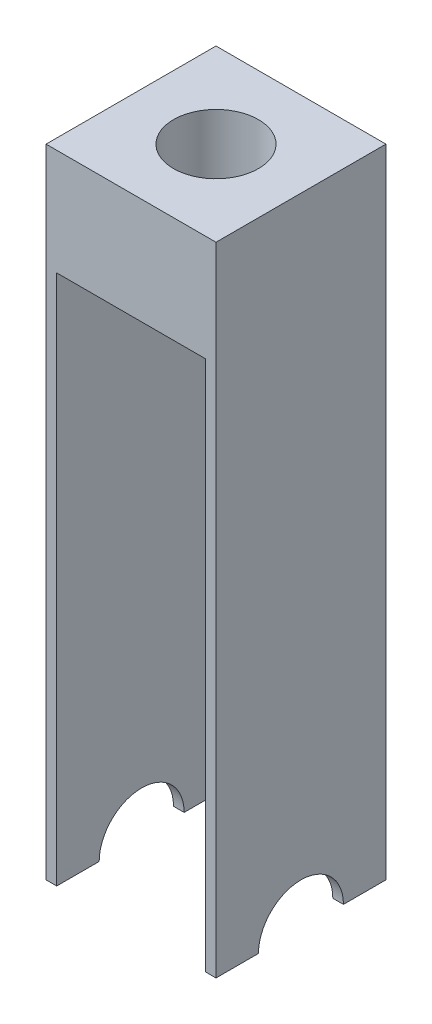
ISO-10303-21;
HEADER;
FILE_DESCRIPTION(('STEP AP214'),'2;1');
FILE_NAME('part.step','',(''),(''),'','','');
FILE_SCHEMA(('AUTOMOTIVE_DESIGN { 1 0 10303 214 1 1 1 1 }'));
ENDSEC;
DATA;
#1=APPLICATION_CONTEXT('core data for automotive mechanical design processes');
#2=APPLICATION_PROTOCOL_DEFINITION('international standard','automotive_design',2000,#1);
#3=PRODUCT_CONTEXT('',#1,'mechanical');
#4=PRODUCT('Part','Part','',(#3));
#5=PRODUCT_RELATED_PRODUCT_CATEGORY('part','',(#4));
#6=PRODUCT_DEFINITION_FORMATION('','',#4);
#7=PRODUCT_DEFINITION_CONTEXT('part definition',#1,'design');
#8=PRODUCT_DEFINITION('design','',#6,#7);
#9=PRODUCT_DEFINITION_SHAPE('','',#8);
#10=(LENGTH_UNIT() NAMED_UNIT(*) SI_UNIT(.MILLI.,.METRE.));
#11=(NAMED_UNIT(*) PLANE_ANGLE_UNIT() SI_UNIT($,.RADIAN.));
#12=(NAMED_UNIT(*) SI_UNIT($,.STERADIAN.) SOLID_ANGLE_UNIT());
#13=UNCERTAINTY_MEASURE_WITH_UNIT(LENGTH_MEASURE(1.E-05),#10,'distance_accuracy_value','');
#14=(GEOMETRIC_REPRESENTATION_CONTEXT(3) GLOBAL_UNCERTAINTY_ASSIGNED_CONTEXT((#13)) GLOBAL_UNIT_ASSIGNED_CONTEXT((#10,
#11,#12)) REPRESENTATION_CONTEXT('',''));
#15=CARTESIAN_POINT('',(0.,0.,0.));
#16=DIRECTION('',(0.,0.,1.));
#17=DIRECTION('',(1.,0.,0.));
#18=AXIS2_PLACEMENT_3D('',#15,#16,#17);
#19=CARTESIAN_POINT('',(80.,-150.,20.));
#20=DIRECTION('',(0.,1.,0.));
#21=DIRECTION('',(0.,0.,1.));
#22=AXIS2_PLACEMENT_3D('',#19,#20,#21);
#23=PLANE('',#22);
#24=DIRECTION('',(-1.,0.,0.));
#25=VECTOR('',#24,1.);
#26=CARTESIAN_POINT('',(80.,-150.,20.));
#27=LINE('',#26,#25);
#28=CARTESIAN_POINT('',(5.00000000000003,-150.,20.));
#29=VERTEX_POINT('',#28);
#30=CARTESIAN_POINT('',(0.,-150.,20.));
#31=VERTEX_POINT('',#30);
#32=EDGE_CURVE('E152',#29,#31,#27,.T.);
#33=ORIENTED_EDGE('',*,*,#32,.F.);
#34=DIRECTION('',(0.,0.,1.));
#35=VECTOR('',#34,1.);
#36=CARTESIAN_POINT('',(5.00000000000003,-150.,-40.));
#37=LINE('',#36,#35);
#38=CARTESIAN_POINT('',(5.00000000000003,-150.,40.));
#39=VERTEX_POINT('',#38);
#40=EDGE_CURVE('E209',#29,#39,#37,.T.);
#41=ORIENTED_EDGE('',*,*,#40,.T.);
#42=DIRECTION('',(-1.,0.,0.));
#43=VECTOR('',#42,1.);
#44=CARTESIAN_POINT('',(80.,-150.,40.));
#45=LINE('',#44,#43);
#46=CARTESIAN_POINT('',(0.,-150.,40.));
#47=VERTEX_POINT('',#46);
#48=EDGE_CURVE('E41',#39,#47,#45,.T.);
#49=ORIENTED_EDGE('',*,*,#48,.T.);
#50=DIRECTION('',(0.,0.,-1.));
#51=VECTOR('',#50,1.);
#52=CARTESIAN_POINT('',(0.,-150.,20.));
#53=LINE('',#52,#51);
#54=EDGE_CURVE('E135',#47,#31,#53,.T.);
#55=ORIENTED_EDGE('',*,*,#54,.T.);
#56=EDGE_LOOP('',(#33,#41,#49,#55));
#57=FACE_BOUND('',#56,.T.);
#58=ADVANCED_FACE('F33',(#57),#23,.F.);
#59=CARTESIAN_POINT('',(80.,-150.,0.));
#60=DIRECTION('',(-1.,0.,0.));
#61=DIRECTION('',(0.,0.,1.));
#62=AXIS2_PLACEMENT_3D('',#59,#60,#61);
#63=CYLINDRICAL_SURFACE('',#62,20.);
#64=DIRECTION('',(-1.,0.,0.));
#65=VECTOR('',#64,1.);
#66=CARTESIAN_POINT('',(80.,-150.,-20.));
#67=LINE('',#66,#65);
#68=CARTESIAN_POINT('',(5.00000000000003,-150.,-20.));
#69=VERTEX_POINT('',#68);
#70=CARTESIAN_POINT('',(0.,-150.,-20.));
#71=VERTEX_POINT('',#70);
#72=EDGE_CURVE('E122',#69,#71,#67,.T.);
#73=ORIENTED_EDGE('',*,*,#72,.F.);
#74=CARTESIAN_POINT('',(5.00000000000002,-150.,0.));
#75=DIRECTION('',(-1.,0.,0.));
#76=DIRECTION('',(0.,-1.,0.));
#77=AXIS2_PLACEMENT_3D('',#74,#75,#76);
#78=CIRCLE('',#77,20.);
#79=EDGE_CURVE('E136',#69,#29,#78,.F.);
#80=ORIENTED_EDGE('',*,*,#79,.T.);
#81=ORIENTED_EDGE('',*,*,#32,.T.);
#82=CARTESIAN_POINT('',(0.,-150.,0.));
#83=DIRECTION('',(-1.,0.,0.));
#84=DIRECTION('',(0.,0.,-1.));
#85=AXIS2_PLACEMENT_3D('',#82,#83,#84);
#86=CIRCLE('',#85,20.);
#87=EDGE_CURVE('E139',#31,#71,#86,.T.);
#88=ORIENTED_EDGE('',*,*,#87,.T.);
#89=EDGE_LOOP('',(#73,#80,#81,#88));
#90=FACE_BOUND('',#89,.T.);
#91=ADVANCED_FACE('F161',(#90),#63,.F.);
#92=CARTESIAN_POINT('',(80.,-150.,-40.));
#93=DIRECTION('',(0.,1.,0.));
#94=DIRECTION('',(0.,0.,1.));
#95=AXIS2_PLACEMENT_3D('',#92,#93,#94);
#96=PLANE('',#95);
#97=DIRECTION('',(-1.,0.,0.));
#98=VECTOR('',#97,1.);
#99=CARTESIAN_POINT('',(80.,-150.,-40.));
#100=LINE('',#99,#98);
#101=CARTESIAN_POINT('',(5.00000000000003,-150.,-40.));
#102=VERTEX_POINT('',#101);
#103=CARTESIAN_POINT('',(0.,-150.,-40.));
#104=VERTEX_POINT('',#103);
#105=EDGE_CURVE('E123',#102,#104,#100,.T.);
#106=ORIENTED_EDGE('',*,*,#105,.F.);
#107=EDGE_CURVE('E181',#102,#69,#37,.T.);
#108=ORIENTED_EDGE('',*,*,#107,.T.);
#109=ORIENTED_EDGE('',*,*,#72,.T.);
#110=DIRECTION('',(0.,0.,-1.));
#111=VECTOR('',#110,1.);
#112=CARTESIAN_POINT('',(0.,-150.,-40.));
#113=LINE('',#112,#111);
#114=EDGE_CURVE('E142',#71,#104,#113,.T.);
#115=ORIENTED_EDGE('',*,*,#114,.T.);
#116=EDGE_LOOP('',(#106,#108,#109,#115));
#117=FACE_BOUND('',#116,.T.);
#118=ADVANCED_FACE('F176',(#117),#96,.F.);
#119=CARTESIAN_POINT('',(80.,-150.,40.));
#120=DIRECTION('',(0.,0.,-1.));
#121=DIRECTION('',(-1.,0.,0.));
#122=AXIS2_PLACEMENT_3D('',#119,#120,#121);
#123=PLANE('',#122);
#124=ORIENTED_EDGE('',*,*,#48,.F.);
#125=DIRECTION('',(0.,-1.,0.));
#126=VECTOR('',#125,1.);
#127=CARTESIAN_POINT('',(5.,100.,40.));
#128=LINE('',#127,#126);
#129=CARTESIAN_POINT('',(5.,100.,40.));
#130=VERTEX_POINT('',#129);
#131=EDGE_CURVE('E226',#130,#39,#128,.T.);
#132=ORIENTED_EDGE('',*,*,#131,.F.);
#133=DIRECTION('',(-1.,0.,0.));
#134=VECTOR('',#133,1.);
#135=CARTESIAN_POINT('',(5.,100.,40.));
#136=LINE('',#135,#134);
#137=CARTESIAN_POINT('',(75.,100.,40.));
#138=VERTEX_POINT('',#137);
#139=EDGE_CURVE('E223',#138,#130,#136,.T.);
#140=ORIENTED_EDGE('',*,*,#139,.F.);
#141=DIRECTION('',(0.,1.,0.));
#142=VECTOR('',#141,1.);
#143=CARTESIAN_POINT('',(75.,100.,40.));
#144=LINE('',#143,#142);
#145=CARTESIAN_POINT('',(75.,-150.,40.));
#146=VERTEX_POINT('',#145);
#147=EDGE_CURVE('E219',#146,#138,#144,.T.);
#148=ORIENTED_EDGE('',*,*,#147,.F.);
#149=CARTESIAN_POINT('',(80.,-150.,40.));
#150=VERTEX_POINT('',#149);
#151=EDGE_CURVE('E11',#150,#146,#45,.T.);
#152=ORIENTED_EDGE('',*,*,#151,.F.);
#153=DIRECTION('',(0.,-1.,0.));
#154=VECTOR('',#153,1.);
#155=CARTESIAN_POINT('',(80.,-150.,40.));
#156=LINE('',#155,#154);
#157=CARTESIAN_POINT('',(80.,150.,40.));
#158=VERTEX_POINT('',#157);
#159=EDGE_CURVE('E148',#158,#150,#156,.T.);
#160=ORIENTED_EDGE('',*,*,#159,.F.);
#161=DIRECTION('',(-1.,0.,0.));
#162=VECTOR('',#161,1.);
#163=CARTESIAN_POINT('',(80.,150.,40.));
#164=LINE('',#163,#162);
#165=CARTESIAN_POINT('',(0.,150.,40.));
#166=VERTEX_POINT('',#165);
#167=EDGE_CURVE('E128',#158,#166,#164,.T.);
#168=ORIENTED_EDGE('',*,*,#167,.T.);
#169=DIRECTION('',(0.,-1.,0.));
#170=VECTOR('',#169,1.);
#171=CARTESIAN_POINT('',(0.,-150.,40.));
#172=LINE('',#171,#170);
#173=EDGE_CURVE('E132',#166,#47,#172,.T.);
#174=ORIENTED_EDGE('',*,*,#173,.T.);
#175=EDGE_LOOP('',(#124,#132,#140,#148,#152,#160,#168,#174));
#176=FACE_BOUND('',#175,.T.);
#177=ADVANCED_FACE('F35',(#176),#123,.F.);
#178=ORIENTED_EDGE('',*,*,#151,.T.);
#179=DIRECTION('',(0.,0.,1.));
#180=VECTOR('',#179,1.);
#181=CARTESIAN_POINT('',(75.,-150.,-40.));
#182=LINE('',#181,#180);
#183=CARTESIAN_POINT('',(75.,-150.,20.));
#184=VERTEX_POINT('',#183);
#185=EDGE_CURVE('E201',#184,#146,#182,.T.);
#186=ORIENTED_EDGE('',*,*,#185,.F.);
#187=CARTESIAN_POINT('',(80.,-150.,20.));
#188=VERTEX_POINT('',#187);
#189=EDGE_CURVE('E153',#188,#184,#27,.T.);
#190=ORIENTED_EDGE('',*,*,#189,.F.);
#191=DIRECTION('',(0.,0.,-1.));
#192=VECTOR('',#191,1.);
#193=CARTESIAN_POINT('',(80.,-150.,20.));
#194=LINE('',#193,#192);
#195=EDGE_CURVE('E92',#150,#188,#194,.T.);
#196=ORIENTED_EDGE('',*,*,#195,.F.);
#197=EDGE_LOOP('',(#178,#186,#190,#196));
#198=FACE_BOUND('',#197,.T.);
#199=ADVANCED_FACE('F205',(#198),#23,.F.);
#200=ORIENTED_EDGE('',*,*,#189,.T.);
#201=CARTESIAN_POINT('',(75.,-150.,0.));
#202=DIRECTION('',(1.,0.,0.));
#203=DIRECTION('',(0.,1.,0.));
#204=AXIS2_PLACEMENT_3D('',#201,#202,#203);
#205=CIRCLE('',#204,20.);
#206=CARTESIAN_POINT('',(75.,-150.,-20.));
#207=VERTEX_POINT('',#206);
#208=EDGE_CURVE('E196',#184,#207,#205,.F.);
#209=ORIENTED_EDGE('',*,*,#208,.T.);
#210=CARTESIAN_POINT('',(80.,-150.,-20.));
#211=VERTEX_POINT('',#210);
#212=EDGE_CURVE('E151',#211,#207,#67,.T.);
#213=ORIENTED_EDGE('',*,*,#212,.F.);
#214=CARTESIAN_POINT('',(80.,-150.,0.));
#215=DIRECTION('',(-1.,0.,0.));
#216=DIRECTION('',(0.,0.,-1.));
#217=AXIS2_PLACEMENT_3D('',#214,#215,#216);
#218=CIRCLE('',#217,20.);
#219=EDGE_CURVE('E108',#188,#211,#218,.T.);
#220=ORIENTED_EDGE('',*,*,#219,.F.);
#221=EDGE_LOOP('',(#200,#209,#213,#220));
#222=FACE_BOUND('',#221,.T.);
#223=ADVANCED_FACE('F271',(#222),#63,.F.);
#224=ORIENTED_EDGE('',*,*,#212,.T.);
#225=CARTESIAN_POINT('',(75.,-150.,-40.));
#226=VERTEX_POINT('',#225);
#227=EDGE_CURVE('E119',#226,#207,#182,.T.);
#228=ORIENTED_EDGE('',*,*,#227,.F.);
#229=CARTESIAN_POINT('',(80.,-150.,-40.));
#230=VERTEX_POINT('',#229);
#231=EDGE_CURVE('E115',#230,#226,#100,.T.);
#232=ORIENTED_EDGE('',*,*,#231,.F.);
#233=DIRECTION('',(0.,0.,-1.));
#234=VECTOR('',#233,1.);
#235=CARTESIAN_POINT('',(80.,-150.,-40.));
#236=LINE('',#235,#234);
#237=EDGE_CURVE('E101',#211,#230,#236,.T.);
#238=ORIENTED_EDGE('',*,*,#237,.F.);
#239=EDGE_LOOP('',(#224,#228,#232,#238));
#240=FACE_BOUND('',#239,.T.);
#241=ADVANCED_FACE('F116',(#240),#96,.F.);
#242=CARTESIAN_POINT('',(80.,-150.,-40.));
#243=DIRECTION('',(0.,0.,1.));
#244=DIRECTION('',(1.,0.,0.));
#245=AXIS2_PLACEMENT_3D('',#242,#243,#244);
#246=PLANE('',#245);
#247=DIRECTION('',(-1.,0.,0.));
#248=VECTOR('',#247,1.);
#249=CARTESIAN_POINT('',(5.,100.,-40.));
#250=LINE('',#249,#248);
#251=CARTESIAN_POINT('',(75.,100.,-40.));
#252=VERTEX_POINT('',#251);
#253=CARTESIAN_POINT('',(5.,100.,-40.));
#254=VERTEX_POINT('',#253);
#255=EDGE_CURVE('E48',#252,#254,#250,.T.);
#256=ORIENTED_EDGE('',*,*,#255,.T.);
#257=DIRECTION('',(0.,-1.,0.));
#258=VECTOR('',#257,1.);
#259=CARTESIAN_POINT('',(5.,100.,-40.));
#260=LINE('',#259,#258);
#261=EDGE_CURVE('E228',#254,#102,#260,.T.);
#262=ORIENTED_EDGE('',*,*,#261,.T.);
#263=ORIENTED_EDGE('',*,*,#105,.T.);
#264=DIRECTION('',(0.,1.,0.));
#265=VECTOR('',#264,1.);
#266=CARTESIAN_POINT('',(0.,-150.,-40.));
#267=LINE('',#266,#265);
#268=CARTESIAN_POINT('',(0.,150.,-40.));
#269=VERTEX_POINT('',#268);
#270=EDGE_CURVE('E145',#104,#269,#267,.T.);
#271=ORIENTED_EDGE('',*,*,#270,.T.);
#272=DIRECTION('',(-1.,0.,0.));
#273=VECTOR('',#272,1.);
#274=CARTESIAN_POINT('',(80.,150.,-40.));
#275=LINE('',#274,#273);
#276=CARTESIAN_POINT('',(80.,150.,-40.));
#277=VERTEX_POINT('',#276);
#278=EDGE_CURVE('E126',#277,#269,#275,.T.);
#279=ORIENTED_EDGE('',*,*,#278,.F.);
#280=DIRECTION('',(0.,1.,0.));
#281=VECTOR('',#280,1.);
#282=CARTESIAN_POINT('',(80.,-150.,-40.));
#283=LINE('',#282,#281);
#284=EDGE_CURVE('E105',#230,#277,#283,.T.);
#285=ORIENTED_EDGE('',*,*,#284,.F.);
#286=ORIENTED_EDGE('',*,*,#231,.T.);
#287=DIRECTION('',(0.,1.,0.));
#288=VECTOR('',#287,1.);
#289=CARTESIAN_POINT('',(75.,100.,-40.));
#290=LINE('',#289,#288);
#291=EDGE_CURVE('E237',#226,#252,#290,.T.);
#292=ORIENTED_EDGE('',*,*,#291,.T.);
#293=EDGE_LOOP('',(#256,#262,#263,#271,#279,#285,#286,#292));
#294=FACE_BOUND('',#293,.T.);
#295=ADVANCED_FACE('F125',(#294),#246,.F.);
#296=CARTESIAN_POINT('',(80.,150.,-40.));
#297=DIRECTION('',(0.,-1.,0.));
#298=DIRECTION('',(0.,0.,-1.));
#299=AXIS2_PLACEMENT_3D('',#296,#297,#298);
#300=PLANE('',#299);
#301=CARTESIAN_POINT('',(40.,150.,0.));
#302=DIRECTION('',(0.,1.,0.));
#303=DIRECTION('',(0.,0.,1.));
#304=AXIS2_PLACEMENT_3D('',#301,#302,#303);
#305=CIRCLE('',#304,20.);
#306=CARTESIAN_POINT('',(40.,150.,20.));
#307=VERTEX_POINT('',#306);
#308=EDGE_CURVE('E242',#307,#307,#305,.T.);
#309=ORIENTED_EDGE('',*,*,#308,.F.);
#310=EDGE_LOOP('',(#309));
#311=FACE_BOUND('',#310,.T.);
#312=DIRECTION('',(0.,0.,1.));
#313=VECTOR('',#312,1.);
#314=CARTESIAN_POINT('',(0.,150.,-40.));
#315=LINE('',#314,#313);
#316=EDGE_CURVE('E84',#269,#166,#315,.T.);
#317=ORIENTED_EDGE('',*,*,#316,.T.);
#318=ORIENTED_EDGE('',*,*,#167,.F.);
#319=DIRECTION('',(0.,0.,1.));
#320=VECTOR('',#319,1.);
#321=CARTESIAN_POINT('',(80.,150.,-40.));
#322=LINE('',#321,#320);
#323=EDGE_CURVE('E57',#277,#158,#322,.T.);
#324=ORIENTED_EDGE('',*,*,#323,.F.);
#325=ORIENTED_EDGE('',*,*,#278,.T.);
#326=EDGE_LOOP('',(#317,#318,#324,#325));
#327=FACE_BOUND('',#326,.T.);
#328=ADVANCED_FACE('F256',(#311,#327),#300,.F.);
#329=CARTESIAN_POINT('',(80.,-150.,0.));
#330=DIRECTION('',(1.,0.,0.));
#331=DIRECTION('',(0.,0.,-1.));
#332=AXIS2_PLACEMENT_3D('',#329,#330,#331);
#333=PLANE('',#332);
#334=ORIENTED_EDGE('',*,*,#159,.T.);
#335=ORIENTED_EDGE('',*,*,#195,.T.);
#336=ORIENTED_EDGE('',*,*,#219,.T.);
#337=ORIENTED_EDGE('',*,*,#237,.T.);
#338=ORIENTED_EDGE('',*,*,#284,.T.);
#339=ORIENTED_EDGE('',*,*,#323,.T.);
#340=EDGE_LOOP('',(#334,#335,#336,#337,#338,#339));
#341=FACE_BOUND('',#340,.T.);
#342=ADVANCED_FACE('F103',(#341),#333,.T.);
#343=CARTESIAN_POINT('',(0.,-150.,0.));
#344=DIRECTION('',(1.,0.,0.));
#345=DIRECTION('',(0.,0.,-1.));
#346=AXIS2_PLACEMENT_3D('',#343,#344,#345);
#347=PLANE('',#346);
#348=ORIENTED_EDGE('',*,*,#173,.F.);
#349=ORIENTED_EDGE('',*,*,#316,.F.);
#350=ORIENTED_EDGE('',*,*,#270,.F.);
#351=ORIENTED_EDGE('',*,*,#114,.F.);
#352=ORIENTED_EDGE('',*,*,#87,.F.);
#353=ORIENTED_EDGE('',*,*,#54,.F.);
#354=EDGE_LOOP('',(#348,#349,#350,#351,#352,#353));
#355=FACE_BOUND('',#354,.T.);
#356=ADVANCED_FACE('F172',(#355),#347,.F.);
#357=CARTESIAN_POINT('',(5.,100.,-40.));
#358=DIRECTION('',(-1.,0.,0.));
#359=DIRECTION('',(0.,-1.,0.));
#360=AXIS2_PLACEMENT_3D('',#357,#358,#359);
#361=PLANE('',#360);
#362=ORIENTED_EDGE('',*,*,#107,.F.);
#363=ORIENTED_EDGE('',*,*,#261,.F.);
#364=DIRECTION('',(0.,0.,1.));
#365=VECTOR('',#364,1.);
#366=CARTESIAN_POINT('',(5.,100.,-40.));
#367=LINE('',#366,#365);
#368=EDGE_CURVE('E203',#254,#130,#367,.T.);
#369=ORIENTED_EDGE('',*,*,#368,.T.);
#370=ORIENTED_EDGE('',*,*,#131,.T.);
#371=ORIENTED_EDGE('',*,*,#40,.F.);
#372=ORIENTED_EDGE('',*,*,#79,.F.);
#373=EDGE_LOOP('',(#362,#363,#369,#370,#371,#372));
#374=FACE_BOUND('',#373,.T.);
#375=ADVANCED_FACE('F298',(#374),#361,.F.);
#376=CARTESIAN_POINT('',(75.,100.,-40.));
#377=DIRECTION('',(1.,0.,0.));
#378=DIRECTION('',(0.,1.,0.));
#379=AXIS2_PLACEMENT_3D('',#376,#377,#378);
#380=PLANE('',#379);
#381=ORIENTED_EDGE('',*,*,#185,.T.);
#382=ORIENTED_EDGE('',*,*,#147,.T.);
#383=DIRECTION('',(0.,0.,1.));
#384=VECTOR('',#383,1.);
#385=CARTESIAN_POINT('',(75.,100.,-40.));
#386=LINE('',#385,#384);
#387=EDGE_CURVE('E208',#252,#138,#386,.T.);
#388=ORIENTED_EDGE('',*,*,#387,.F.);
#389=ORIENTED_EDGE('',*,*,#291,.F.);
#390=ORIENTED_EDGE('',*,*,#227,.T.);
#391=ORIENTED_EDGE('',*,*,#208,.F.);
#392=EDGE_LOOP('',(#381,#382,#388,#389,#390,#391));
#393=FACE_BOUND('',#392,.T.);
#394=ADVANCED_FACE('F198',(#393),#380,.F.);
#395=CARTESIAN_POINT('',(5.,100.,-40.));
#396=DIRECTION('',(0.,1.,0.));
#397=DIRECTION('',(-1.,0.,0.));
#398=AXIS2_PLACEMENT_3D('',#395,#396,#397);
#399=PLANE('',#398);
#400=ORIENTED_EDGE('',*,*,#139,.T.);
#401=ORIENTED_EDGE('',*,*,#368,.F.);
#402=ORIENTED_EDGE('',*,*,#255,.F.);
#403=ORIENTED_EDGE('',*,*,#387,.T.);
#404=EDGE_LOOP('',(#400,#401,#402,#403));
#405=FACE_BOUND('',#404,.T.);
#406=ADVANCED_FACE('F236',(#405),#399,.F.);
#407=CARTESIAN_POINT('',(40.,110.,0.));
#408=DIRECTION('',(0.,1.,0.));
#409=DIRECTION('',(0.,0.,1.));
#410=AXIS2_PLACEMENT_3D('',#407,#408,#409);
#411=CYLINDRICAL_SURFACE('',#410,20.);
#412=CARTESIAN_POINT('',(40.,110.,0.));
#413=DIRECTION('',(0.,1.,0.));
#414=DIRECTION('',(0.,0.,1.));
#415=AXIS2_PLACEMENT_3D('',#412,#413,#414);
#416=CIRCLE('',#415,20.);
#417=CARTESIAN_POINT('',(40.,110.,20.));
#418=VERTEX_POINT('',#417);
#419=EDGE_CURVE('E231',#418,#418,#416,.T.);
#420=ORIENTED_EDGE('',*,*,#419,.F.);
#421=EDGE_LOOP('',(#420));
#422=FACE_BOUND('',#421,.T.);
#423=ORIENTED_EDGE('',*,*,#308,.T.);
#424=EDGE_LOOP('',(#423));
#425=FACE_BOUND('',#424,.T.);
#426=ADVANCED_FACE('F250',(#422,#425),#411,.F.);
#427=CARTESIAN_POINT('',(40.,110.,0.));
#428=DIRECTION('',(0.,1.,0.));
#429=DIRECTION('',(0.,0.,1.));
#430=AXIS2_PLACEMENT_3D('',#427,#428,#429);
#431=PLANE('',#430);
#432=ORIENTED_EDGE('',*,*,#419,.T.);
#433=EDGE_LOOP('',(#432));
#434=FACE_BOUND('',#433,.T.);
#435=ADVANCED_FACE('F248',(#434),#431,.T.);
#436=CLOSED_SHELL('',(#58,#91,#118,#177,#199,#223,#241,#295,#328,#342,#356,#375,#394,#406,#426,#435));
#437=MANIFOLD_SOLID_BREP('B2',#436);
#438=ADVANCED_BREP_SHAPE_REPRESENTATION('',(#18,#437),#14);
#439=SHAPE_DEFINITION_REPRESENTATION(#9,#438);
ENDSEC;
END-ISO-10303-21;
